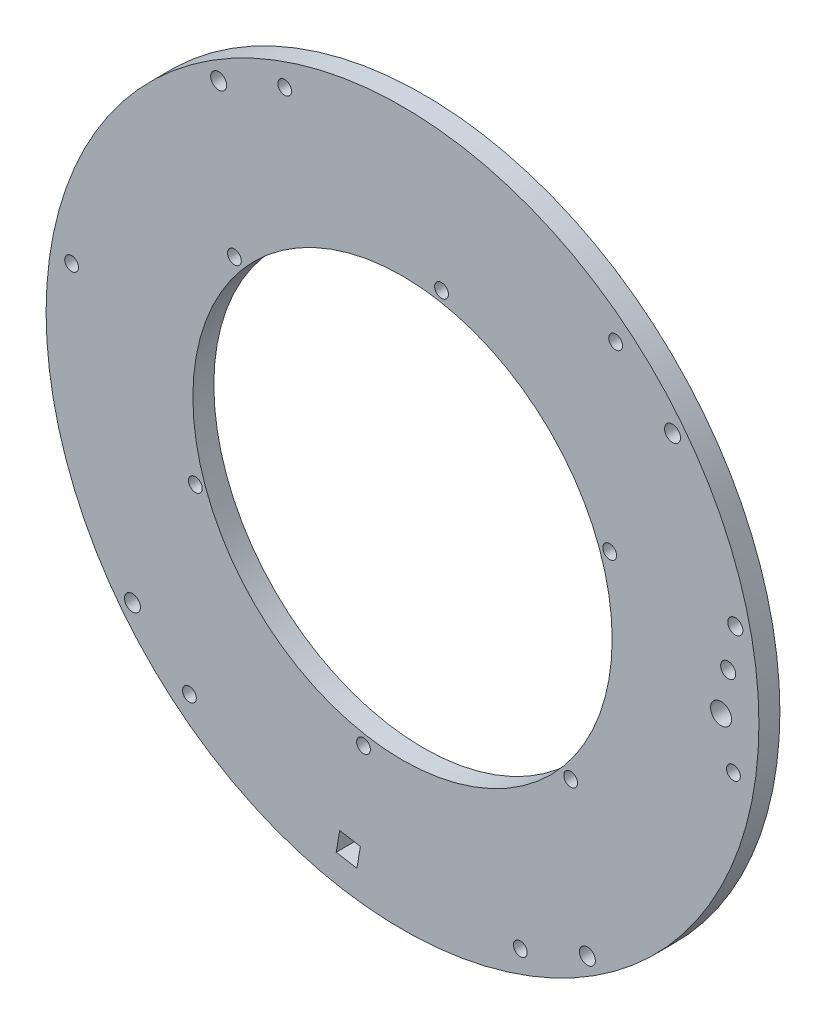
ISO-10303-21;
HEADER;
FILE_DESCRIPTION(('STEP AP214'),'2;1');
FILE_NAME('part.step','',(''),(''),'','','');
FILE_SCHEMA(('AUTOMOTIVE_DESIGN { 1 0 10303 214 1 1 1 1 }'));
ENDSEC;
DATA;
#1=APPLICATION_CONTEXT('core data for automotive mechanical design processes');
#2=APPLICATION_PROTOCOL_DEFINITION('international standard','automotive_design',2000,#1);
#3=PRODUCT_CONTEXT('',#1,'mechanical');
#4=PRODUCT('Part','Part','',(#3));
#5=PRODUCT_RELATED_PRODUCT_CATEGORY('part','',(#4));
#6=PRODUCT_DEFINITION_FORMATION('','',#4);
#7=PRODUCT_DEFINITION_CONTEXT('part definition',#1,'design');
#8=PRODUCT_DEFINITION('design','',#6,#7);
#9=PRODUCT_DEFINITION_SHAPE('','',#8);
#10=(LENGTH_UNIT() NAMED_UNIT(*) SI_UNIT(.MILLI.,.METRE.));
#11=(NAMED_UNIT(*) PLANE_ANGLE_UNIT() SI_UNIT($,.RADIAN.));
#12=(NAMED_UNIT(*) SI_UNIT($,.STERADIAN.) SOLID_ANGLE_UNIT());
#13=UNCERTAINTY_MEASURE_WITH_UNIT(LENGTH_MEASURE(1.E-05),#10,'distance_accuracy_value','');
#14=(GEOMETRIC_REPRESENTATION_CONTEXT(3) GLOBAL_UNCERTAINTY_ASSIGNED_CONTEXT((#13)) GLOBAL_UNIT_ASSIGNED_CONTEXT((#10,
#11,#12)) REPRESENTATION_CONTEXT('',''));
#15=CARTESIAN_POINT('',(0.,0.,0.));
#16=DIRECTION('',(0.,0.,1.));
#17=DIRECTION('',(1.,0.,0.));
#18=AXIS2_PLACEMENT_3D('',#15,#16,#17);
#19=CARTESIAN_POINT('',(51.7383814674162,55.5933193944043,6.35));
#20=DIRECTION('',(0.,0.,1.));
#21=DIRECTION('',(1.,0.,0.));
#22=AXIS2_PLACEMENT_3D('',#19,#20,#21);
#23=PLANE('',#22);
#24=CARTESIAN_POINT('',(150.37112060869,65.0771640261398,6.35));
#25=DIRECTION('',(0.,0.,-1.));
#26=DIRECTION('',(-1.,0.,0.));
#27=AXIS2_PLACEMENT_3D('',#24,#25,#26);
#28=CIRCLE('',#27,2.28600000000001);
#29=CARTESIAN_POINT('',(148.08512060869,65.0771640261398,6.35));
#30=VERTEX_POINT('',#29);
#31=EDGE_CURVE('E302',#30,#30,#28,.T.);
#32=ORIENTED_EDGE('',*,*,#31,.T.);
#33=EDGE_LOOP('',(#32));
#34=FACE_BOUND('',#33,.T.);
#35=CARTESIAN_POINT('',(152.531464440599,77.5920717176863,6.35));
#36=DIRECTION('',(0.,0.,-1.));
#37=DIRECTION('',(-1.,0.,0.));
#38=AXIS2_PLACEMENT_3D('',#35,#36,#37);
#39=CIRCLE('',#38,2.28600000000001);
#40=CARTESIAN_POINT('',(150.245464440599,77.5920717176863,6.35));
#41=VERTEX_POINT('',#40);
#42=EDGE_CURVE('E303',#41,#41,#39,.T.);
#43=ORIENTED_EDGE('',*,*,#42,.T.);
#44=EDGE_LOOP('',(#43));
#45=FACE_BOUND('',#44,.T.);
#46=CARTESIAN_POINT('',(148.210776776781,52.5622563345932,6.35));
#47=DIRECTION('',(0.,0.,-1.));
#48=DIRECTION('',(-1.,0.,0.));
#49=AXIS2_PLACEMENT_3D('',#46,#47,#48);
#50=CIRCLE('',#49,3.175);
#51=CARTESIAN_POINT('',(145.035776776781,52.5622563345932,6.35));
#52=VERTEX_POINT('',#51);
#53=EDGE_CURVE('E276',#52,#52,#50,.T.);
#54=ORIENTED_EDGE('',*,*,#53,.T.);
#55=EDGE_LOOP('',(#54));
#56=FACE_BOUND('',#55,.T.);
#57=CARTESIAN_POINT('',(-3.94859207387842,142.429971856793,6.35));
#58=DIRECTION('',(0.,0.,1.));
#59=DIRECTION('',(1.,0.,0.));
#60=AXIS2_PLACEMENT_3D('',#57,#58,#59);
#61=CIRCLE('',#60,2.41300000000001);
#62=CARTESIAN_POINT('',(-1.53559207387841,142.429971856793,6.35));
#63=VERTEX_POINT('',#62);
#64=EDGE_CURVE('E121',#63,#63,#61,.T.);
#65=ORIENTED_EDGE('',*,*,#64,.F.);
#66=EDGE_LOOP('',(#65));
#67=FACE_BOUND('',#66,.T.);
#68=CARTESIAN_POINT('',(133.515154010071,118.700755207102,6.35));
#69=DIRECTION('',(0.,0.,1.));
#70=DIRECTION('',(1.,0.,0.));
#71=AXIS2_PLACEMENT_3D('',#68,#69,#70);
#72=CIRCLE('',#71,2.41299999999999);
#73=CARTESIAN_POINT('',(135.928154010071,118.700755207102,6.35));
#74=VERTEX_POINT('',#73);
#75=EDGE_CURVE('E124',#74,#74,#72,.T.);
#76=ORIENTED_EDGE('',*,*,#75,.F.);
#77=EDGE_LOOP('',(#76));
#78=FACE_BOUND('',#77,.T.);
#79=DIRECTION('',(0.985425802483984,-0.170105813536155,0.));
#80=VECTOR('',#79,1.);
#81=CARTESIAN_POINT('',(34.7796823869292,-42.6487059842367,6.35));
#82=LINE('',#81,#80);
#83=CARTESIAN_POINT('',(31.6509554640284,-42.108620026257,6.35));
#84=VERTEX_POINT('',#83);
#85=CARTESIAN_POINT('',(37.9084093098017,-43.1887919422115,6.35));
#86=VERTEX_POINT('',#85);
#87=EDGE_CURVE('E99',#84,#86,#82,.T.);
#88=ORIENTED_EDGE('',*,*,#87,.F.);
#89=DIRECTION('',(-0.170105813536155,-0.985425802483984,0.));
#90=VECTOR('',#89,1.);
#91=CARTESIAN_POINT('',(48.6096545445154,56.133405352384,6.35));
#92=LINE('',#91,#90);
#93=CARTESIAN_POINT('',(32.731127379983,-35.8511661804837,6.35));
#94=VERTEX_POINT('',#93);
#95=EDGE_CURVE('E146',#94,#84,#92,.T.);
#96=ORIENTED_EDGE('',*,*,#95,.F.);
#97=DIRECTION('',(-0.985425802483984,0.170105813536155,0.));
#98=VECTOR('',#97,1.);
#99=CARTESIAN_POINT('',(35.8598543028838,-36.3912521384634,6.35));
#100=LINE('',#99,#98);
#101=CARTESIAN_POINT('',(38.9885812257563,-36.9313380964383,6.35));
#102=VERTEX_POINT('',#101);
#103=EDGE_CURVE('E143',#102,#94,#100,.T.);
#104=ORIENTED_EDGE('',*,*,#103,.F.);
#105=DIRECTION('',(0.170105813536157,0.985425802483983,0.));
#106=VECTOR('',#105,1.);
#107=CARTESIAN_POINT('',(54.8671083902889,55.0532334364294,6.35));
#108=LINE('',#107,#106);
#109=EDGE_CURVE('E134',#86,#102,#108,.T.);
#110=ORIENTED_EDGE('',*,*,#109,.F.);
#111=EDGE_LOOP('',(#88,#96,#104,#110));
#112=FACE_BOUND('',#111,.T.);
#113=CARTESIAN_POINT('',(-30.0667064610019,-7.50922856992647,6.35));
#114=DIRECTION('',(0.,0.,1.));
#115=DIRECTION('',(1.,0.,0.));
#116=AXIS2_PLACEMENT_3D('',#113,#114,#115);
#117=CIRCLE('',#116,2.413);
#118=CARTESIAN_POINT('',(-27.6537064610019,-7.50922856992647,6.35));
#119=VERTEX_POINT('',#118);
#120=EDGE_CURVE('E156',#119,#119,#117,.T.);
#121=ORIENTED_EDGE('',*,*,#120,.F.);
#122=EDGE_LOOP('',(#121));
#123=FACE_BOUND('',#122,.T.);
#124=CARTESIAN_POINT('',(107.725712791653,-31.295181319494,6.35));
#125=DIRECTION('',(0.,0.,1.));
#126=DIRECTION('',(1.,0.,0.));
#127=AXIS2_PLACEMENT_3D('',#124,#125,#126);
#128=CIRCLE('',#127,2.413);
#129=CARTESIAN_POINT('',(110.138712791653,-31.295181319494,6.35));
#130=VERTEX_POINT('',#129);
#131=EDGE_CURVE('E150',#130,#130,#128,.T.);
#132=ORIENTED_EDGE('',*,*,#131,.F.);
#133=EDGE_LOOP('',(#132));
#134=FACE_BOUND('',#133,.T.);
#135=CARTESIAN_POINT('',(-10.9976612248078,33.015795785306,6.35));
#136=DIRECTION('',(0.,0.,1.));
#137=DIRECTION('',(1.,0.,0.));
#138=AXIS2_PLACEMENT_3D('',#135,#136,#137);
#139=CIRCLE('',#138,2.08500000000095);
#140=CARTESIAN_POINT('',(-8.91266122480683,33.015795785306,6.35));
#141=VERTEX_POINT('',#140);
#142=EDGE_CURVE('E202',#141,#141,#139,.T.);
#143=ORIENTED_EDGE('',*,*,#142,.F.);
#144=EDGE_LOOP('',(#143));
#145=FACE_BOUND('',#144,.T.);
#146=CARTESIAN_POINT('',(0.817651121282282,98.6355642942263,6.35));
#147=DIRECTION('',(0.,0.,1.));
#148=DIRECTION('',(1.,0.,0.));
#149=AXIS2_PLACEMENT_3D('',#146,#147,#148);
#150=CIRCLE('',#149,2.08500000000095);
#151=CARTESIAN_POINT('',(2.90265112128323,98.6355642942263,6.35));
#152=VERTEX_POINT('',#151);
#153=EDGE_CURVE('E198',#152,#152,#150,.T.);
#154=ORIENTED_EDGE('',*,*,#153,.F.);
#155=EDGE_LOOP('',(#154));
#156=FACE_BOUND('',#155,.T.);
#157=CARTESIAN_POINT('',(63.553693813506,121.213087903324,6.35));
#158=DIRECTION('',(0.,0.,1.));
#159=DIRECTION('',(1.,0.,0.));
#160=AXIS2_PLACEMENT_3D('',#157,#158,#159);
#161=CIRCLE('',#160,2.08500000000095);
#162=CARTESIAN_POINT('',(65.6386938135069,121.213087903324,6.35));
#163=VERTEX_POINT('',#162);
#164=EDGE_CURVE('E194',#163,#163,#161,.T.);
#165=ORIENTED_EDGE('',*,*,#164,.F.);
#166=EDGE_LOOP('',(#165));
#167=FACE_BOUND('',#166,.T.);
#168=CARTESIAN_POINT('',(114.47442415964,78.1708430035021,6.35));
#169=DIRECTION('',(0.,0.,1.));
#170=DIRECTION('',(1.,0.,0.));
#171=AXIS2_PLACEMENT_3D('',#168,#169,#170);
#172=CIRCLE('',#171,2.08500000000095);
#173=CARTESIAN_POINT('',(116.559424159641,78.1708430035021,6.35));
#174=VERTEX_POINT('',#173);
#175=EDGE_CURVE('E190',#174,#174,#172,.T.);
#176=ORIENTED_EDGE('',*,*,#175,.F.);
#177=EDGE_LOOP('',(#176));
#178=FACE_BOUND('',#177,.T.);
#179=CARTESIAN_POINT('',(102.65911181355,12.5510744945819,6.35));
#180=DIRECTION('',(0.,0.,1.));
#181=DIRECTION('',(1.,0.,0.));
#182=AXIS2_PLACEMENT_3D('',#179,#180,#181);
#183=CIRCLE('',#182,2.08500000000095);
#184=CARTESIAN_POINT('',(104.744111813551,12.5510744945819,6.35));
#185=VERTEX_POINT('',#184);
#186=EDGE_CURVE('E171',#185,#185,#183,.T.);
#187=ORIENTED_EDGE('',*,*,#186,.F.);
#188=EDGE_LOOP('',(#187));
#189=FACE_BOUND('',#188,.T.);
#190=CARTESIAN_POINT('',(39.9230691213263,-10.0264491145159,6.35));
#191=DIRECTION('',(0.,0.,1.));
#192=DIRECTION('',(1.,0.,0.));
#193=AXIS2_PLACEMENT_3D('',#190,#191,#192);
#194=CIRCLE('',#193,2.08500000000095);
#195=CARTESIAN_POINT('',(42.0080691213273,-10.0264491145159,6.35));
#196=VERTEX_POINT('',#195);
#197=EDGE_CURVE('E210',#196,#196,#194,.T.);
#198=ORIENTED_EDGE('',*,*,#197,.F.);
#199=EDGE_LOOP('',(#198));
#200=FACE_BOUND('',#199,.T.);
#201=CARTESIAN_POINT('',(-48.4871131713407,72.2489558102432,6.35));
#202=DIRECTION('',(0.,0.,1.));
#203=DIRECTION('',(0.499999999999998,-0.86602540378444,0.));
#204=AXIS2_PLACEMENT_3D('',#201,#202,#203);
#205=CIRCLE('',#204,2.08499999999936);
#206=CARTESIAN_POINT('',(-47.4446131713411,70.4432928433532,6.35));
#207=VERTEX_POINT('',#206);
#208=EDGE_CURVE('E220',#207,#207,#205,.T.);
#209=ORIENTED_EDGE('',*,*,#208,.F.);
#210=EDGE_LOOP('',(#209));
#211=FACE_BOUND('',#210,.T.);
#212=CARTESIAN_POINT('',(16.0498384003517,150.718962066348,6.35));
#213=DIRECTION('',(0.,0.,1.));
#214=DIRECTION('',(-0.500000000000004,-0.866025403784436,0.));
#215=AXIS2_PLACEMENT_3D('',#212,#213,#214);
#216=CIRCLE('',#215,2.08499999999936);
#217=CARTESIAN_POINT('',(15.007338400352,148.913299099458,6.35));
#218=VERTEX_POINT('',#217);
#219=EDGE_CURVE('E228',#218,#218,#216,.T.);
#220=ORIENTED_EDGE('',*,*,#219,.F.);
#221=EDGE_LOOP('',(#220));
#222=FACE_BOUND('',#221,.T.);
#223=CARTESIAN_POINT('',(116.275333039108,134.063325650509,6.35));
#224=DIRECTION('',(0.,0.,1.));
#225=DIRECTION('',(-1.,0.,0.));
#226=AXIS2_PLACEMENT_3D('',#223,#224,#225);
#227=CIRCLE('',#226,2.08499999999936);
#228=CARTESIAN_POINT('',(114.190333039109,134.063325650509,6.35));
#229=VERTEX_POINT('',#228);
#230=EDGE_CURVE('E236',#229,#229,#227,.T.);
#231=ORIENTED_EDGE('',*,*,#230,.F.);
#232=EDGE_LOOP('',(#231));
#233=FACE_BOUND('',#232,.T.);
#234=CARTESIAN_POINT('',(151.963876106173,38.9376829785646,6.35));
#235=DIRECTION('',(0.,0.,1.));
#236=DIRECTION('',(-0.499999999999992,0.866025403784443,0.));
#237=AXIS2_PLACEMENT_3D('',#234,#235,#236);
#238=CIRCLE('',#237,2.08499999999936);
#239=CARTESIAN_POINT('',(150.921376106173,40.7433459454546,6.35));
#240=VERTEX_POINT('',#239);
#241=EDGE_CURVE('E244',#240,#240,#238,.T.);
#242=ORIENTED_EDGE('',*,*,#241,.F.);
#243=EDGE_LOOP('',(#242));
#244=FACE_BOUND('',#243,.T.);
#245=CARTESIAN_POINT('',(87.42692453448,-39.5323232775401,6.35));
#246=DIRECTION('',(0.,0.,1.));
#247=DIRECTION('',(0.50000000000001,0.866025403784433,0.));
#248=AXIS2_PLACEMENT_3D('',#245,#246,#247);
#249=CIRCLE('',#248,2.08499999999936);
#250=CARTESIAN_POINT('',(88.4694245344797,-37.7266603106501,6.35));
#251=VERTEX_POINT('',#250);
#252=EDGE_CURVE('E214',#251,#251,#249,.T.);
#253=ORIENTED_EDGE('',*,*,#252,.F.);
#254=EDGE_LOOP('',(#253));
#255=FACE_BOUND('',#254,.T.);
#256=CARTESIAN_POINT('',(-12.7985701042758,-22.8766868617009,6.35));
#257=DIRECTION('',(0.,0.,1.));
#258=DIRECTION('',(1.,0.,0.));
#259=AXIS2_PLACEMENT_3D('',#256,#257,#258);
#260=CIRCLE('',#259,2.08499999999936);
#261=CARTESIAN_POINT('',(-10.7135701042765,-22.8766868617009,6.35));
#262=VERTEX_POINT('',#261);
#263=EDGE_CURVE('E219',#262,#262,#260,.T.);
#264=ORIENTED_EDGE('',*,*,#263,.F.);
#265=EDGE_LOOP('',(#264));
#266=FACE_BOUND('',#265,.T.);
#267=CARTESIAN_POINT('',(51.7383814674162,55.5933193944043,6.35));
#268=DIRECTION('',(0.,0.,1.));
#269=DIRECTION('',(1.,0.,0.));
#270=AXIS2_PLACEMENT_3D('',#267,#268,#269);
#271=CIRCLE('',#270,107.95);
#272=CARTESIAN_POINT('',(159.688381467416,55.5933193944043,6.35));
#273=VERTEX_POINT('',#272);
#274=EDGE_CURVE('E14',#273,#273,#271,.T.);
#275=ORIENTED_EDGE('',*,*,#274,.T.);
#276=EDGE_LOOP('',(#275));
#277=FACE_BOUND('',#276,.T.);
#278=CARTESIAN_POINT('',(51.7383814674162,55.5933193944043,6.35));
#279=DIRECTION('',(0.,0.,1.));
#280=DIRECTION('',(1.,0.,0.));
#281=AXIS2_PLACEMENT_3D('',#278,#279,#280);
#282=CIRCLE('',#281,63.5);
#283=CARTESIAN_POINT('',(115.238381467416,55.5933193944043,6.35));
#284=VERTEX_POINT('',#283);
#285=EDGE_CURVE('E262',#284,#284,#282,.T.);
#286=ORIENTED_EDGE('',*,*,#285,.F.);
#287=EDGE_LOOP('',(#286));
#288=FACE_BOUND('',#287,.T.);
#289=ADVANCED_FACE('F49',(#34,#45,#56,#67,#78,#112,#123,#134,#145,#156,#167,#178,#189,#200,#211,
#222,#233,#244,#255,#266,#277,#288),#23,.T.);
#290=CARTESIAN_POINT('',(51.7383814674162,55.5933193944043,0.));
#291=DIRECTION('',(0.,0.,1.));
#292=DIRECTION('',(1.,0.,0.));
#293=AXIS2_PLACEMENT_3D('',#290,#291,#292);
#294=PLANE('',#293);
#295=CARTESIAN_POINT('',(150.37112060869,65.0771640261398,0.));
#296=DIRECTION('',(0.,0.,1.));
#297=DIRECTION('',(1.,0.,0.));
#298=AXIS2_PLACEMENT_3D('',#295,#296,#297);
#299=CIRCLE('',#298,2.28600000000001);
#300=CARTESIAN_POINT('',(152.65712060869,65.0771640261398,0.));
#301=VERTEX_POINT('',#300);
#302=EDGE_CURVE('E53',#301,#301,#299,.T.);
#303=ORIENTED_EDGE('',*,*,#302,.T.);
#304=EDGE_LOOP('',(#303));
#305=FACE_BOUND('',#304,.T.);
#306=CARTESIAN_POINT('',(152.531464440599,77.5920717176863,0.));
#307=DIRECTION('',(0.,0.,1.));
#308=DIRECTION('',(1.,0.,0.));
#309=AXIS2_PLACEMENT_3D('',#306,#307,#308);
#310=CIRCLE('',#309,2.28600000000001);
#311=CARTESIAN_POINT('',(154.817464440599,77.5920717176863,0.));
#312=VERTEX_POINT('',#311);
#313=EDGE_CURVE('E275',#312,#312,#310,.T.);
#314=ORIENTED_EDGE('',*,*,#313,.T.);
#315=EDGE_LOOP('',(#314));
#316=FACE_BOUND('',#315,.T.);
#317=CARTESIAN_POINT('',(148.210776776781,52.5622563345932,0.));
#318=DIRECTION('',(0.,0.,1.));
#319=DIRECTION('',(1.,0.,0.));
#320=AXIS2_PLACEMENT_3D('',#317,#318,#319);
#321=CIRCLE('',#320,3.175);
#322=CARTESIAN_POINT('',(151.385776776781,52.5622563345932,0.));
#323=VERTEX_POINT('',#322);
#324=EDGE_CURVE('E272',#323,#323,#321,.T.);
#325=ORIENTED_EDGE('',*,*,#324,.T.);
#326=EDGE_LOOP('',(#325));
#327=FACE_BOUND('',#326,.T.);
#328=CARTESIAN_POINT('',(-3.94859207387842,142.429971856793,0.));
#329=DIRECTION('',(0.,0.,1.));
#330=DIRECTION('',(1.,0.,0.));
#331=AXIS2_PLACEMENT_3D('',#328,#329,#330);
#332=CIRCLE('',#331,2.41300000000001);
#333=CARTESIAN_POINT('',(-1.53559207387841,142.429971856793,0.));
#334=VERTEX_POINT('',#333);
#335=EDGE_CURVE('E115',#334,#334,#332,.T.);
#336=ORIENTED_EDGE('',*,*,#335,.T.);
#337=EDGE_LOOP('',(#336));
#338=FACE_BOUND('',#337,.T.);
#339=CARTESIAN_POINT('',(133.515154010071,118.700755207102,0.));
#340=DIRECTION('',(0.,0.,1.));
#341=DIRECTION('',(1.,0.,0.));
#342=AXIS2_PLACEMENT_3D('',#339,#340,#341);
#343=CIRCLE('',#342,2.41299999999999);
#344=CARTESIAN_POINT('',(135.928154010071,118.700755207102,0.));
#345=VERTEX_POINT('',#344);
#346=EDGE_CURVE('E287',#345,#345,#343,.T.);
#347=ORIENTED_EDGE('',*,*,#346,.T.);
#348=EDGE_LOOP('',(#347));
#349=FACE_BOUND('',#348,.T.);
#350=DIRECTION('',(-0.170105813536155,-0.985425802483984,0.));
#351=VECTOR('',#350,1.);
#352=CARTESIAN_POINT('',(31.6509554640284,-42.108620026257,0.));
#353=LINE('',#352,#351);
#354=CARTESIAN_POINT('',(32.731127379983,-35.8511661804837,0.));
#355=VERTEX_POINT('',#354);
#356=CARTESIAN_POINT('',(31.6509554640284,-42.108620026257,0.));
#357=VERTEX_POINT('',#356);
#358=EDGE_CURVE('E103',#355,#357,#353,.T.);
#359=ORIENTED_EDGE('',*,*,#358,.T.);
#360=DIRECTION('',(0.985425802483984,-0.170105813536155,0.));
#361=VECTOR('',#360,1.);
#362=CARTESIAN_POINT('',(37.9084093098017,-43.1887919422115,0.));
#363=LINE('',#362,#361);
#364=CARTESIAN_POINT('',(37.9084093098017,-43.1887919422115,0.));
#365=VERTEX_POINT('',#364);
#366=EDGE_CURVE('E96',#357,#365,#363,.T.);
#367=ORIENTED_EDGE('',*,*,#366,.T.);
#368=DIRECTION('',(0.170105813536157,0.985425802483983,0.));
#369=VECTOR('',#368,1.);
#370=CARTESIAN_POINT('',(38.9885812257563,-36.9313380964383,0.));
#371=LINE('',#370,#369);
#372=CARTESIAN_POINT('',(38.9885812257563,-36.9313380964383,0.));
#373=VERTEX_POINT('',#372);
#374=EDGE_CURVE('E106',#365,#373,#371,.T.);
#375=ORIENTED_EDGE('',*,*,#374,.T.);
#376=DIRECTION('',(-0.985425802483984,0.170105813536155,0.));
#377=VECTOR('',#376,1.);
#378=CARTESIAN_POINT('',(32.731127379983,-35.8511661804837,0.));
#379=LINE('',#378,#377);
#380=EDGE_CURVE('E75',#373,#355,#379,.T.);
#381=ORIENTED_EDGE('',*,*,#380,.T.);
#382=EDGE_LOOP('',(#359,#367,#375,#381));
#383=FACE_BOUND('',#382,.T.);
#384=CARTESIAN_POINT('',(-30.0667064610019,-7.50922856992647,0.));
#385=DIRECTION('',(0.,0.,1.));
#386=DIRECTION('',(1.,0.,0.));
#387=AXIS2_PLACEMENT_3D('',#384,#385,#386);
#388=CIRCLE('',#387,2.413);
#389=CARTESIAN_POINT('',(-27.6537064610019,-7.50922856992647,0.));
#390=VERTEX_POINT('',#389);
#391=EDGE_CURVE('E151',#390,#390,#388,.T.);
#392=ORIENTED_EDGE('',*,*,#391,.T.);
#393=EDGE_LOOP('',(#392));
#394=FACE_BOUND('',#393,.T.);
#395=CARTESIAN_POINT('',(107.725712791653,-31.295181319494,0.));
#396=DIRECTION('',(0.,0.,1.));
#397=DIRECTION('',(1.,0.,0.));
#398=AXIS2_PLACEMENT_3D('',#395,#396,#397);
#399=CIRCLE('',#398,2.413);
#400=CARTESIAN_POINT('',(110.138712791653,-31.295181319494,0.));
#401=VERTEX_POINT('',#400);
#402=EDGE_CURVE('E160',#401,#401,#399,.T.);
#403=ORIENTED_EDGE('',*,*,#402,.T.);
#404=EDGE_LOOP('',(#403));
#405=FACE_BOUND('',#404,.T.);
#406=CARTESIAN_POINT('',(-10.9976612248078,33.015795785306,0.));
#407=DIRECTION('',(0.,0.,1.));
#408=DIRECTION('',(0.499999999999998,-0.86602540378444,0.));
#409=AXIS2_PLACEMENT_3D('',#406,#407,#408);
#410=CIRCLE('',#409,2.08500000000095);
#411=CARTESIAN_POINT('',(-9.95516122480731,31.2101328184147,0.));
#412=VERTEX_POINT('',#411);
#413=EDGE_CURVE('E167',#412,#412,#410,.T.);
#414=ORIENTED_EDGE('',*,*,#413,.T.);
#415=EDGE_LOOP('',(#414));
#416=FACE_BOUND('',#415,.T.);
#417=CARTESIAN_POINT('',(0.817651121282282,98.6355642942263,0.));
#418=DIRECTION('',(0.,0.,1.));
#419=DIRECTION('',(-0.500000000000004,-0.866025403784436,0.));
#420=AXIS2_PLACEMENT_3D('',#417,#418,#419);
#421=CIRCLE('',#420,2.08500000000095);
#422=CARTESIAN_POINT('',(-0.224848878718199,96.8299013273349,0.));
#423=VERTEX_POINT('',#422);
#424=EDGE_CURVE('E172',#423,#423,#421,.T.);
#425=ORIENTED_EDGE('',*,*,#424,.T.);
#426=EDGE_LOOP('',(#425));
#427=FACE_BOUND('',#426,.T.);
#428=CARTESIAN_POINT('',(63.553693813506,121.213087903324,0.));
#429=DIRECTION('',(0.,0.,1.));
#430=DIRECTION('',(-1.,0.,0.));
#431=AXIS2_PLACEMENT_3D('',#428,#429,#430);
#432=CIRCLE('',#431,2.08500000000095);
#433=CARTESIAN_POINT('',(61.468693813505,121.213087903324,0.));
#434=VERTEX_POINT('',#433);
#435=EDGE_CURVE('E176',#434,#434,#432,.T.);
#436=ORIENTED_EDGE('',*,*,#435,.T.);
#437=EDGE_LOOP('',(#436));
#438=FACE_BOUND('',#437,.T.);
#439=CARTESIAN_POINT('',(114.47442415964,78.1708430035021,0.));
#440=DIRECTION('',(0.,0.,1.));
#441=DIRECTION('',(-0.499999999999992,0.866025403784443,0.));
#442=AXIS2_PLACEMENT_3D('',#439,#440,#441);
#443=CIRCLE('',#442,2.08500000000095);
#444=CARTESIAN_POINT('',(113.43192415964,79.9765059703934,0.));
#445=VERTEX_POINT('',#444);
#446=EDGE_CURVE('E180',#445,#445,#443,.T.);
#447=ORIENTED_EDGE('',*,*,#446,.T.);
#448=EDGE_LOOP('',(#447));
#449=FACE_BOUND('',#448,.T.);
#450=CARTESIAN_POINT('',(102.65911181355,12.5510744945819,0.));
#451=DIRECTION('',(0.,0.,1.));
#452=DIRECTION('',(0.50000000000001,0.866025403784433,0.));
#453=AXIS2_PLACEMENT_3D('',#450,#451,#452);
#454=CIRCLE('',#453,2.08500000000095);
#455=CARTESIAN_POINT('',(103.70161181355,14.3567374614732,0.));
#456=VERTEX_POINT('',#455);
#457=EDGE_CURVE('E155',#456,#456,#454,.T.);
#458=ORIENTED_EDGE('',*,*,#457,.T.);
#459=EDGE_LOOP('',(#458));
#460=FACE_BOUND('',#459,.T.);
#461=CARTESIAN_POINT('',(39.9230691213263,-10.0264491145159,0.));
#462=DIRECTION('',(0.,0.,1.));
#463=DIRECTION('',(1.,0.,0.));
#464=AXIS2_PLACEMENT_3D('',#461,#462,#463);
#465=CIRCLE('',#464,2.08500000000095);
#466=CARTESIAN_POINT('',(42.0080691213273,-10.0264491145159,0.));
#467=VERTEX_POINT('',#466);
#468=EDGE_CURVE('E206',#467,#467,#465,.T.);
#469=ORIENTED_EDGE('',*,*,#468,.T.);
#470=EDGE_LOOP('',(#469));
#471=FACE_BOUND('',#470,.T.);
#472=CARTESIAN_POINT('',(-48.4871131713407,72.2489558102432,0.));
#473=DIRECTION('',(0.,0.,1.));
#474=DIRECTION('',(0.499999999999998,-0.86602540378444,0.));
#475=AXIS2_PLACEMENT_3D('',#472,#473,#474);
#476=CIRCLE('',#475,2.08499999999936);
#477=CARTESIAN_POINT('',(-47.4446131713411,70.4432928433532,0.));
#478=VERTEX_POINT('',#477);
#479=EDGE_CURVE('E215',#478,#478,#476,.T.);
#480=ORIENTED_EDGE('',*,*,#479,.T.);
#481=EDGE_LOOP('',(#480));
#482=FACE_BOUND('',#481,.T.);
#483=CARTESIAN_POINT('',(16.0498384003517,150.718962066348,0.));
#484=DIRECTION('',(0.,0.,1.));
#485=DIRECTION('',(-0.500000000000004,-0.866025403784436,0.));
#486=AXIS2_PLACEMENT_3D('',#483,#484,#485);
#487=CIRCLE('',#486,2.08499999999936);
#488=CARTESIAN_POINT('',(15.007338400352,148.913299099458,0.));
#489=VERTEX_POINT('',#488);
#490=EDGE_CURVE('E224',#489,#489,#487,.T.);
#491=ORIENTED_EDGE('',*,*,#490,.T.);
#492=EDGE_LOOP('',(#491));
#493=FACE_BOUND('',#492,.T.);
#494=CARTESIAN_POINT('',(116.275333039108,134.063325650509,0.));
#495=DIRECTION('',(0.,0.,1.));
#496=DIRECTION('',(-1.,0.,0.));
#497=AXIS2_PLACEMENT_3D('',#494,#495,#496);
#498=CIRCLE('',#497,2.08499999999936);
#499=CARTESIAN_POINT('',(114.190333039109,134.063325650509,0.));
#500=VERTEX_POINT('',#499);
#501=EDGE_CURVE('E232',#500,#500,#498,.T.);
#502=ORIENTED_EDGE('',*,*,#501,.T.);
#503=EDGE_LOOP('',(#502));
#504=FACE_BOUND('',#503,.T.);
#505=CARTESIAN_POINT('',(151.963876106173,38.9376829785646,0.));
#506=DIRECTION('',(0.,0.,1.));
#507=DIRECTION('',(-0.499999999999992,0.866025403784443,0.));
#508=AXIS2_PLACEMENT_3D('',#505,#506,#507);
#509=CIRCLE('',#508,2.08499999999936);
#510=CARTESIAN_POINT('',(150.921376106173,40.7433459454546,0.));
#511=VERTEX_POINT('',#510);
#512=EDGE_CURVE('E240',#511,#511,#509,.T.);
#513=ORIENTED_EDGE('',*,*,#512,.T.);
#514=EDGE_LOOP('',(#513));
#515=FACE_BOUND('',#514,.T.);
#516=CARTESIAN_POINT('',(87.42692453448,-39.5323232775401,0.));
#517=DIRECTION('',(0.,0.,1.));
#518=DIRECTION('',(0.50000000000001,0.866025403784433,0.));
#519=AXIS2_PLACEMENT_3D('',#516,#517,#518);
#520=CIRCLE('',#519,2.08499999999936);
#521=CARTESIAN_POINT('',(88.4694245344797,-37.7266603106501,0.));
#522=VERTEX_POINT('',#521);
#523=EDGE_CURVE('E248',#522,#522,#520,.T.);
#524=ORIENTED_EDGE('',*,*,#523,.T.);
#525=EDGE_LOOP('',(#524));
#526=FACE_BOUND('',#525,.T.);
#527=CARTESIAN_POINT('',(-12.7985701042758,-22.8766868617009,0.));
#528=DIRECTION('',(0.,0.,1.));
#529=DIRECTION('',(1.,0.,0.));
#530=AXIS2_PLACEMENT_3D('',#527,#528,#529);
#531=CIRCLE('',#530,2.08499999999936);
#532=CARTESIAN_POINT('',(-10.7135701042765,-22.8766868617009,0.));
#533=VERTEX_POINT('',#532);
#534=EDGE_CURVE('E254',#533,#533,#531,.T.);
#535=ORIENTED_EDGE('',*,*,#534,.T.);
#536=EDGE_LOOP('',(#535));
#537=FACE_BOUND('',#536,.T.);
#538=CARTESIAN_POINT('',(51.7383814674162,55.5933193944043,0.));
#539=DIRECTION('',(0.,0.,1.));
#540=DIRECTION('',(1.,0.,0.));
#541=AXIS2_PLACEMENT_3D('',#538,#539,#540);
#542=CIRCLE('',#541,107.95);
#543=CARTESIAN_POINT('',(159.688381467416,55.5933193944043,0.));
#544=VERTEX_POINT('',#543);
#545=EDGE_CURVE('E59',#544,#544,#542,.T.);
#546=ORIENTED_EDGE('',*,*,#545,.F.);
#547=EDGE_LOOP('',(#546));
#548=FACE_BOUND('',#547,.T.);
#549=CARTESIAN_POINT('',(51.7383814674162,55.5933193944043,0.));
#550=DIRECTION('',(0.,0.,1.));
#551=DIRECTION('',(1.,0.,0.));
#552=AXIS2_PLACEMENT_3D('',#549,#550,#551);
#553=CIRCLE('',#552,63.5);
#554=CARTESIAN_POINT('',(115.238381467416,55.5933193944043,0.));
#555=VERTEX_POINT('',#554);
#556=EDGE_CURVE('E258',#555,#555,#553,.T.);
#557=ORIENTED_EDGE('',*,*,#556,.T.);
#558=EDGE_LOOP('',(#557));
#559=FACE_BOUND('',#558,.T.);
#560=ADVANCED_FACE('F111',(#305,#316,#327,#338,#349,#383,#394,#405,#416,#427,#438,#449,#460,
#471,#482,#493,#504,#515,#526,#537,#548,#559),#294,.F.);
#561=CARTESIAN_POINT('',(51.7383814674162,55.5933193944043,6.35));
#562=DIRECTION('',(0.,0.,-1.));
#563=DIRECTION('',(-1.,0.,0.));
#564=AXIS2_PLACEMENT_3D('',#561,#562,#563);
#565=CYLINDRICAL_SURFACE('',#564,107.95);
#566=ORIENTED_EDGE('',*,*,#274,.F.);
#567=EDGE_LOOP('',(#566));
#568=FACE_BOUND('',#567,.T.);
#569=ORIENTED_EDGE('',*,*,#545,.T.);
#570=EDGE_LOOP('',(#569));
#571=FACE_BOUND('',#570,.T.);
#572=ADVANCED_FACE('F51',(#568,#571),#565,.T.);
#573=CARTESIAN_POINT('',(51.7383814674162,55.5933193944043,6.35));
#574=DIRECTION('',(0.,0.,-1.));
#575=DIRECTION('',(-1.,0.,0.));
#576=AXIS2_PLACEMENT_3D('',#573,#574,#575);
#577=CYLINDRICAL_SURFACE('',#576,63.5);
#578=ORIENTED_EDGE('',*,*,#285,.T.);
#579=EDGE_LOOP('',(#578));
#580=FACE_BOUND('',#579,.T.);
#581=ORIENTED_EDGE('',*,*,#556,.F.);
#582=EDGE_LOOP('',(#581));
#583=FACE_BOUND('',#582,.T.);
#584=ADVANCED_FACE('F329',(#580,#583),#577,.F.);
#585=CARTESIAN_POINT('',(-12.7985701042758,-22.8766868617009,0.));
#586=DIRECTION('',(0.,0.,1.));
#587=DIRECTION('',(1.,0.,0.));
#588=AXIS2_PLACEMENT_3D('',#585,#586,#587);
#589=CYLINDRICAL_SURFACE('',#588,2.08499999999936);
#590=ORIENTED_EDGE('',*,*,#534,.F.);
#591=EDGE_LOOP('',(#590));
#592=FACE_BOUND('',#591,.T.);
#593=ORIENTED_EDGE('',*,*,#263,.T.);
#594=EDGE_LOOP('',(#593));
#595=FACE_BOUND('',#594,.T.);
#596=ADVANCED_FACE('F332',(#592,#595),#589,.F.);
#597=CARTESIAN_POINT('',(87.42692453448,-39.5323232775401,0.));
#598=DIRECTION('',(0.,0.,1.));
#599=DIRECTION('',(1.,0.,0.));
#600=AXIS2_PLACEMENT_3D('',#597,#598,#599);
#601=CYLINDRICAL_SURFACE('',#600,2.08499999999936);
#602=ORIENTED_EDGE('',*,*,#523,.F.);
#603=EDGE_LOOP('',(#602));
#604=FACE_BOUND('',#603,.T.);
#605=ORIENTED_EDGE('',*,*,#252,.T.);
#606=EDGE_LOOP('',(#605));
#607=FACE_BOUND('',#606,.T.);
#608=ADVANCED_FACE('F336',(#604,#607),#601,.F.);
#609=CARTESIAN_POINT('',(151.963876106173,38.9376829785646,0.));
#610=DIRECTION('',(0.,0.,1.));
#611=DIRECTION('',(1.,0.,0.));
#612=AXIS2_PLACEMENT_3D('',#609,#610,#611);
#613=CYLINDRICAL_SURFACE('',#612,2.08499999999936);
#614=ORIENTED_EDGE('',*,*,#512,.F.);
#615=EDGE_LOOP('',(#614));
#616=FACE_BOUND('',#615,.T.);
#617=ORIENTED_EDGE('',*,*,#241,.T.);
#618=EDGE_LOOP('',(#617));
#619=FACE_BOUND('',#618,.T.);
#620=ADVANCED_FACE('F340',(#616,#619),#613,.F.);
#621=CARTESIAN_POINT('',(116.275333039108,134.063325650509,0.));
#622=DIRECTION('',(0.,0.,1.));
#623=DIRECTION('',(1.,0.,0.));
#624=AXIS2_PLACEMENT_3D('',#621,#622,#623);
#625=CYLINDRICAL_SURFACE('',#624,2.08499999999936);
#626=ORIENTED_EDGE('',*,*,#501,.F.);
#627=EDGE_LOOP('',(#626));
#628=FACE_BOUND('',#627,.T.);
#629=ORIENTED_EDGE('',*,*,#230,.T.);
#630=EDGE_LOOP('',(#629));
#631=FACE_BOUND('',#630,.T.);
#632=ADVANCED_FACE('F344',(#628,#631),#625,.F.);
#633=CARTESIAN_POINT('',(16.0498384003517,150.718962066348,0.));
#634=DIRECTION('',(0.,0.,1.));
#635=DIRECTION('',(1.,0.,0.));
#636=AXIS2_PLACEMENT_3D('',#633,#634,#635);
#637=CYLINDRICAL_SURFACE('',#636,2.08499999999936);
#638=ORIENTED_EDGE('',*,*,#490,.F.);
#639=EDGE_LOOP('',(#638));
#640=FACE_BOUND('',#639,.T.);
#641=ORIENTED_EDGE('',*,*,#219,.T.);
#642=EDGE_LOOP('',(#641));
#643=FACE_BOUND('',#642,.T.);
#644=ADVANCED_FACE('F348',(#640,#643),#637,.F.);
#645=CARTESIAN_POINT('',(-48.4871131713407,72.2489558102432,0.));
#646=DIRECTION('',(0.,0.,1.));
#647=DIRECTION('',(1.,0.,0.));
#648=AXIS2_PLACEMENT_3D('',#645,#646,#647);
#649=CYLINDRICAL_SURFACE('',#648,2.08499999999936);
#650=ORIENTED_EDGE('',*,*,#479,.F.);
#651=EDGE_LOOP('',(#650));
#652=FACE_BOUND('',#651,.T.);
#653=ORIENTED_EDGE('',*,*,#208,.T.);
#654=EDGE_LOOP('',(#653));
#655=FACE_BOUND('',#654,.T.);
#656=ADVANCED_FACE('F352',(#652,#655),#649,.F.);
#657=CARTESIAN_POINT('',(39.9230691213263,-10.0264491145159,0.));
#658=DIRECTION('',(0.,0.,1.));
#659=DIRECTION('',(1.,0.,0.));
#660=AXIS2_PLACEMENT_3D('',#657,#658,#659);
#661=CYLINDRICAL_SURFACE('',#660,2.08500000000095);
#662=ORIENTED_EDGE('',*,*,#197,.T.);
#663=EDGE_LOOP('',(#662));
#664=FACE_BOUND('',#663,.T.);
#665=ORIENTED_EDGE('',*,*,#468,.F.);
#666=EDGE_LOOP('',(#665));
#667=FACE_BOUND('',#666,.T.);
#668=ADVANCED_FACE('F356',(#664,#667),#661,.F.);
#669=CARTESIAN_POINT('',(102.65911181355,12.5510744945819,0.));
#670=DIRECTION('',(0.,0.,1.));
#671=DIRECTION('',(1.,0.,0.));
#672=AXIS2_PLACEMENT_3D('',#669,#670,#671);
#673=CYLINDRICAL_SURFACE('',#672,2.08500000000095);
#674=ORIENTED_EDGE('',*,*,#186,.T.);
#675=EDGE_LOOP('',(#674));
#676=FACE_BOUND('',#675,.T.);
#677=ORIENTED_EDGE('',*,*,#457,.F.);
#678=EDGE_LOOP('',(#677));
#679=FACE_BOUND('',#678,.T.);
#680=ADVANCED_FACE('F360',(#676,#679),#673,.F.);
#681=CARTESIAN_POINT('',(114.47442415964,78.1708430035021,0.));
#682=DIRECTION('',(0.,0.,1.));
#683=DIRECTION('',(1.,0.,0.));
#684=AXIS2_PLACEMENT_3D('',#681,#682,#683);
#685=CYLINDRICAL_SURFACE('',#684,2.08500000000095);
#686=ORIENTED_EDGE('',*,*,#175,.T.);
#687=EDGE_LOOP('',(#686));
#688=FACE_BOUND('',#687,.T.);
#689=ORIENTED_EDGE('',*,*,#446,.F.);
#690=EDGE_LOOP('',(#689));
#691=FACE_BOUND('',#690,.T.);
#692=ADVANCED_FACE('F364',(#688,#691),#685,.F.);
#693=CARTESIAN_POINT('',(63.553693813506,121.213087903324,0.));
#694=DIRECTION('',(0.,0.,1.));
#695=DIRECTION('',(1.,0.,0.));
#696=AXIS2_PLACEMENT_3D('',#693,#694,#695);
#697=CYLINDRICAL_SURFACE('',#696,2.08500000000095);
#698=ORIENTED_EDGE('',*,*,#164,.T.);
#699=EDGE_LOOP('',(#698));
#700=FACE_BOUND('',#699,.T.);
#701=ORIENTED_EDGE('',*,*,#435,.F.);
#702=EDGE_LOOP('',(#701));
#703=FACE_BOUND('',#702,.T.);
#704=ADVANCED_FACE('F368',(#700,#703),#697,.F.);
#705=CARTESIAN_POINT('',(0.817651121282282,98.6355642942263,0.));
#706=DIRECTION('',(0.,0.,1.));
#707=DIRECTION('',(1.,0.,0.));
#708=AXIS2_PLACEMENT_3D('',#705,#706,#707);
#709=CYLINDRICAL_SURFACE('',#708,2.08500000000095);
#710=ORIENTED_EDGE('',*,*,#153,.T.);
#711=EDGE_LOOP('',(#710));
#712=FACE_BOUND('',#711,.T.);
#713=ORIENTED_EDGE('',*,*,#424,.F.);
#714=EDGE_LOOP('',(#713));
#715=FACE_BOUND('',#714,.T.);
#716=ADVANCED_FACE('F372',(#712,#715),#709,.F.);
#717=CARTESIAN_POINT('',(-10.9976612248078,33.015795785306,0.));
#718=DIRECTION('',(0.,0.,1.));
#719=DIRECTION('',(1.,0.,0.));
#720=AXIS2_PLACEMENT_3D('',#717,#718,#719);
#721=CYLINDRICAL_SURFACE('',#720,2.08500000000095);
#722=ORIENTED_EDGE('',*,*,#142,.T.);
#723=EDGE_LOOP('',(#722));
#724=FACE_BOUND('',#723,.T.);
#725=ORIENTED_EDGE('',*,*,#413,.F.);
#726=EDGE_LOOP('',(#725));
#727=FACE_BOUND('',#726,.T.);
#728=ADVANCED_FACE('F376',(#724,#727),#721,.F.);
#729=CARTESIAN_POINT('',(107.725712791653,-31.295181319494,0.));
#730=DIRECTION('',(0.,0.,1.));
#731=DIRECTION('',(1.,0.,0.));
#732=AXIS2_PLACEMENT_3D('',#729,#730,#731);
#733=CYLINDRICAL_SURFACE('',#732,2.413);
#734=ORIENTED_EDGE('',*,*,#402,.F.);
#735=EDGE_LOOP('',(#734));
#736=FACE_BOUND('',#735,.T.);
#737=ORIENTED_EDGE('',*,*,#131,.T.);
#738=EDGE_LOOP('',(#737));
#739=FACE_BOUND('',#738,.T.);
#740=ADVANCED_FACE('F380',(#736,#739),#733,.F.);
#741=CARTESIAN_POINT('',(-30.0667064610019,-7.50922856992647,0.));
#742=DIRECTION('',(0.,0.,1.));
#743=DIRECTION('',(1.,0.,0.));
#744=AXIS2_PLACEMENT_3D('',#741,#742,#743);
#745=CYLINDRICAL_SURFACE('',#744,2.413);
#746=ORIENTED_EDGE('',*,*,#391,.F.);
#747=EDGE_LOOP('',(#746));
#748=FACE_BOUND('',#747,.T.);
#749=ORIENTED_EDGE('',*,*,#120,.T.);
#750=EDGE_LOOP('',(#749));
#751=FACE_BOUND('',#750,.T.);
#752=ADVANCED_FACE('F384',(#748,#751),#745,.F.);
#753=CARTESIAN_POINT('',(37.9084093098017,-43.1887919422115,0.));
#754=DIRECTION('',(-0.170105813536155,-0.985425802483983,0.));
#755=DIRECTION('',(0.985425802483984,-0.170105813536155,0.));
#756=AXIS2_PLACEMENT_3D('',#753,#754,#755);
#757=PLANE('',#756);
#758=ORIENTED_EDGE('',*,*,#87,.T.);
#759=DIRECTION('',(0.,0.,1.));
#760=VECTOR('',#759,1.);
#761=CARTESIAN_POINT('',(37.9084093098017,-43.1887919422115,0.));
#762=LINE('',#761,#760);
#763=EDGE_CURVE('E67',#365,#86,#762,.T.);
#764=ORIENTED_EDGE('',*,*,#763,.F.);
#765=ORIENTED_EDGE('',*,*,#366,.F.);
#766=DIRECTION('',(0.,0.,1.));
#767=VECTOR('',#766,1.);
#768=CARTESIAN_POINT('',(31.6509554640284,-42.108620026257,0.));
#769=LINE('',#768,#767);
#770=EDGE_CURVE('E131',#357,#84,#769,.T.);
#771=ORIENTED_EDGE('',*,*,#770,.T.);
#772=EDGE_LOOP('',(#758,#764,#765,#771));
#773=FACE_BOUND('',#772,.T.);
#774=ADVANCED_FACE('F93',(#773),#757,.F.);
#775=CARTESIAN_POINT('',(31.6509554640284,-42.108620026257,0.));
#776=DIRECTION('',(-0.985425802483983,0.170105813536155,0.));
#777=DIRECTION('',(-0.170105813536155,-0.985425802483984,0.));
#778=AXIS2_PLACEMENT_3D('',#775,#776,#777);
#779=PLANE('',#778);
#780=ORIENTED_EDGE('',*,*,#95,.T.);
#781=ORIENTED_EDGE('',*,*,#770,.F.);
#782=ORIENTED_EDGE('',*,*,#358,.F.);
#783=DIRECTION('',(0.,0.,1.));
#784=VECTOR('',#783,1.);
#785=CARTESIAN_POINT('',(32.731127379983,-35.8511661804837,0.));
#786=LINE('',#785,#784);
#787=EDGE_CURVE('E135',#355,#94,#786,.T.);
#788=ORIENTED_EDGE('',*,*,#787,.T.);
#789=EDGE_LOOP('',(#780,#781,#782,#788));
#790=FACE_BOUND('',#789,.T.);
#791=ADVANCED_FACE('F391',(#790),#779,.F.);
#792=CARTESIAN_POINT('',(32.731127379983,-35.8511661804837,0.));
#793=DIRECTION('',(0.170105813536155,0.985425802483984,0.));
#794=DIRECTION('',(-0.985425802483984,0.170105813536155,0.));
#795=AXIS2_PLACEMENT_3D('',#792,#793,#794);
#796=PLANE('',#795);
#797=ORIENTED_EDGE('',*,*,#103,.T.);
#798=ORIENTED_EDGE('',*,*,#787,.F.);
#799=ORIENTED_EDGE('',*,*,#380,.F.);
#800=DIRECTION('',(0.,0.,1.));
#801=VECTOR('',#800,1.);
#802=CARTESIAN_POINT('',(38.9885812257563,-36.9313380964383,0.));
#803=LINE('',#802,#801);
#804=EDGE_CURVE('E102',#373,#102,#803,.T.);
#805=ORIENTED_EDGE('',*,*,#804,.T.);
#806=EDGE_LOOP('',(#797,#798,#799,#805));
#807=FACE_BOUND('',#806,.T.);
#808=ADVANCED_FACE('F395',(#807),#796,.F.);
#809=CARTESIAN_POINT('',(38.9885812257563,-36.9313380964383,0.));
#810=DIRECTION('',(0.985425802483983,-0.170105813536157,0.));
#811=DIRECTION('',(0.170105813536157,0.985425802483983,0.));
#812=AXIS2_PLACEMENT_3D('',#809,#810,#811);
#813=PLANE('',#812);
#814=ORIENTED_EDGE('',*,*,#109,.T.);
#815=ORIENTED_EDGE('',*,*,#804,.F.);
#816=ORIENTED_EDGE('',*,*,#374,.F.);
#817=ORIENTED_EDGE('',*,*,#763,.T.);
#818=EDGE_LOOP('',(#814,#815,#816,#817));
#819=FACE_BOUND('',#818,.T.);
#820=ADVANCED_FACE('F107',(#819),#813,.F.);
#821=CARTESIAN_POINT('',(133.515154010071,118.700755207102,0.));
#822=DIRECTION('',(0.,0.,1.));
#823=DIRECTION('',(1.,0.,0.));
#824=AXIS2_PLACEMENT_3D('',#821,#822,#823);
#825=CYLINDRICAL_SURFACE('',#824,2.41299999999999);
#826=ORIENTED_EDGE('',*,*,#346,.F.);
#827=EDGE_LOOP('',(#826));
#828=FACE_BOUND('',#827,.T.);
#829=ORIENTED_EDGE('',*,*,#75,.T.);
#830=EDGE_LOOP('',(#829));
#831=FACE_BOUND('',#830,.T.);
#832=ADVANCED_FACE('F394',(#828,#831),#825,.F.);
#833=CARTESIAN_POINT('',(-3.94859207387842,142.429971856793,0.));
#834=DIRECTION('',(0.,0.,1.));
#835=DIRECTION('',(1.,0.,0.));
#836=AXIS2_PLACEMENT_3D('',#833,#834,#835);
#837=CYLINDRICAL_SURFACE('',#836,2.41300000000001);
#838=ORIENTED_EDGE('',*,*,#335,.F.);
#839=EDGE_LOOP('',(#838));
#840=FACE_BOUND('',#839,.T.);
#841=ORIENTED_EDGE('',*,*,#64,.T.);
#842=EDGE_LOOP('',(#841));
#843=FACE_BOUND('',#842,.T.);
#844=ADVANCED_FACE('F403',(#840,#843),#837,.F.);
#845=CARTESIAN_POINT('',(148.210776776781,52.5622563345932,6.35));
#846=DIRECTION('',(0.,0.,-1.));
#847=DIRECTION('',(-1.,0.,0.));
#848=AXIS2_PLACEMENT_3D('',#845,#846,#847);
#849=CYLINDRICAL_SURFACE('',#848,3.175);
#850=ORIENTED_EDGE('',*,*,#53,.F.);
#851=EDGE_LOOP('',(#850));
#852=FACE_BOUND('',#851,.T.);
#853=ORIENTED_EDGE('',*,*,#324,.F.);
#854=EDGE_LOOP('',(#853));
#855=FACE_BOUND('',#854,.T.);
#856=ADVANCED_FACE('F320',(#852,#855),#849,.F.);
#857=CARTESIAN_POINT('',(152.531464440599,77.5920717176863,6.35));
#858=DIRECTION('',(0.,0.,-1.));
#859=DIRECTION('',(-1.,0.,0.));
#860=AXIS2_PLACEMENT_3D('',#857,#858,#859);
#861=CYLINDRICAL_SURFACE('',#860,2.28600000000001);
#862=ORIENTED_EDGE('',*,*,#42,.F.);
#863=EDGE_LOOP('',(#862));
#864=FACE_BOUND('',#863,.T.);
#865=ORIENTED_EDGE('',*,*,#313,.F.);
#866=EDGE_LOOP('',(#865));
#867=FACE_BOUND('',#866,.T.);
#868=ADVANCED_FACE('F315',(#864,#867),#861,.F.);
#869=CARTESIAN_POINT('',(150.37112060869,65.0771640261398,6.35));
#870=DIRECTION('',(0.,0.,-1.));
#871=DIRECTION('',(-1.,0.,0.));
#872=AXIS2_PLACEMENT_3D('',#869,#870,#871);
#873=CYLINDRICAL_SURFACE('',#872,2.28600000000001);
#874=ORIENTED_EDGE('',*,*,#31,.F.);
#875=EDGE_LOOP('',(#874));
#876=FACE_BOUND('',#875,.T.);
#877=ORIENTED_EDGE('',*,*,#302,.F.);
#878=EDGE_LOOP('',(#877));
#879=FACE_BOUND('',#878,.T.);
#880=ADVANCED_FACE('F312',(#876,#879),#873,.F.);
#881=CLOSED_SHELL('',(#289,#560,#572,#584,#596,#608,#620,#632,#644,#656,#668,#680,#692,#704,
#716,#728,#740,#752,#774,#791,#808,#820,#832,#844,#856,#868,#880));
#882=MANIFOLD_SOLID_BREP('B2',#881);
#883=ADVANCED_BREP_SHAPE_REPRESENTATION('',(#18,#882),#14);
#884=SHAPE_DEFINITION_REPRESENTATION(#9,#883);
ENDSEC;
END-ISO-10303-21;
